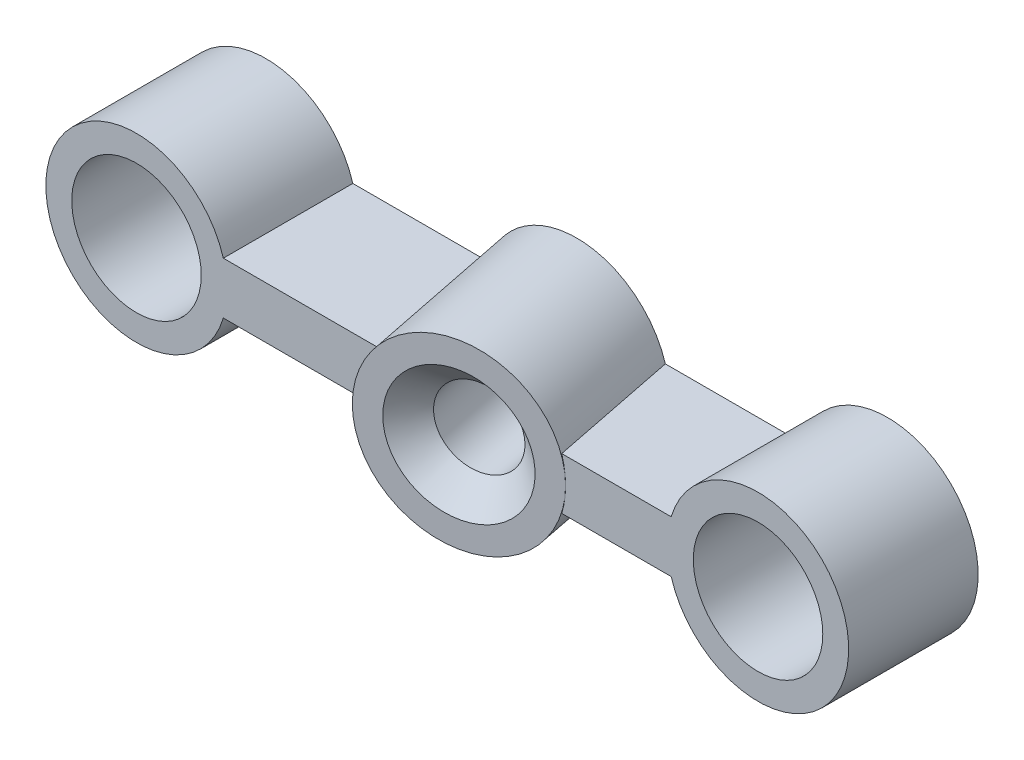
ISO-10303-21;
HEADER;
FILE_DESCRIPTION(('STEP AP214'),'2;1');
FILE_NAME('part.step','',(''),(''),'','','');
FILE_SCHEMA(('AUTOMOTIVE_DESIGN { 1 0 10303 214 1 1 1 1 }'));
ENDSEC;
DATA;
#1=APPLICATION_CONTEXT('core data for automotive mechanical design processes');
#2=APPLICATION_PROTOCOL_DEFINITION('international standard','automotive_design',2000,#1);
#3=PRODUCT_CONTEXT('',#1,'mechanical');
#4=PRODUCT('Part','Part','',(#3));
#5=PRODUCT_RELATED_PRODUCT_CATEGORY('part','',(#4));
#6=PRODUCT_DEFINITION_FORMATION('','',#4);
#7=PRODUCT_DEFINITION_CONTEXT('part definition',#1,'design');
#8=PRODUCT_DEFINITION('design','',#6,#7);
#9=PRODUCT_DEFINITION_SHAPE('','',#8);
#10=(LENGTH_UNIT() NAMED_UNIT(*) SI_UNIT(.MILLI.,.METRE.));
#11=(NAMED_UNIT(*) PLANE_ANGLE_UNIT() SI_UNIT($,.RADIAN.));
#12=(NAMED_UNIT(*) SI_UNIT($,.STERADIAN.) SOLID_ANGLE_UNIT());
#13=UNCERTAINTY_MEASURE_WITH_UNIT(LENGTH_MEASURE(1.E-05),#10,'distance_accuracy_value','');
#14=(GEOMETRIC_REPRESENTATION_CONTEXT(3) GLOBAL_UNCERTAINTY_ASSIGNED_CONTEXT((#13)) GLOBAL_UNIT_ASSIGNED_CONTEXT((#10,
#11,#12)) REPRESENTATION_CONTEXT('',''));
#15=CARTESIAN_POINT('',(0.,0.,0.));
#16=DIRECTION('',(0.,0.,1.));
#17=DIRECTION('',(1.,0.,0.));
#18=AXIS2_PLACEMENT_3D('',#15,#16,#17);
#19=CARTESIAN_POINT('',(-24.,0.,5.));
#20=DIRECTION('',(0.,0.,1.));
#21=DIRECTION('',(1.,0.,0.));
#22=AXIS2_PLACEMENT_3D('',#19,#20,#21);
#23=PLANE('',#22);
#24=CARTESIAN_POINT('',(0.,0.,5.));
#25=DIRECTION('',(0.,0.,1.));
#26=DIRECTION('',(1.,0.,0.));
#27=AXIS2_PLACEMENT_3D('',#24,#25,#26);
#28=CIRCLE('',#27,2.5);
#29=CARTESIAN_POINT('',(2.5,0.,5.));
#30=VERTEX_POINT('',#29);
#31=EDGE_CURVE('E144',#30,#30,#28,.T.);
#32=ORIENTED_EDGE('',*,*,#31,.F.);
#33=EDGE_LOOP('',(#32));
#34=FACE_BOUND('',#33,.T.);
#35=CARTESIAN_POINT('',(-11.,0.,5.));
#36=DIRECTION('',(0.,0.,1.));
#37=DIRECTION('',(-1.,0.,0.));
#38=AXIS2_PLACEMENT_3D('',#35,#36,#37);
#39=ELLIPSE('',#38,3.56931365951495,3.5);
#40=CARTESIAN_POINT('',(-7.57947372470259,1.,5.));
#41=VERTEX_POINT('',#40);
#42=CARTESIAN_POINT('',(-7.43068634048505,0.,5.));
#43=VERTEX_POINT('',#42);
#44=EDGE_CURVE('E51',#41,#43,#39,.F.);
#45=ORIENTED_EDGE('',*,*,#44,.T.);
#46=CARTESIAN_POINT('',(-7.57947372470258,-1.,5.));
#47=VERTEX_POINT('',#46);
#48=EDGE_CURVE('E55',#43,#47,#39,.F.);
#49=ORIENTED_EDGE('',*,*,#48,.T.);
#50=DIRECTION('',(1.,0.,0.));
#51=VECTOR('',#50,1.);
#52=CARTESIAN_POINT('',(-3.35410196624968,-1.,5.));
#53=LINE('',#52,#51);
#54=CARTESIAN_POINT('',(-3.35410196624969,-0.999999999999999,5.));
#55=VERTEX_POINT('',#54);
#56=EDGE_CURVE('E153',#47,#55,#53,.T.);
#57=ORIENTED_EDGE('',*,*,#56,.T.);
#58=CARTESIAN_POINT('',(0.,0.,5.));
#59=DIRECTION('',(0.,0.,1.));
#60=DIRECTION('',(1.,0.,0.));
#61=AXIS2_PLACEMENT_3D('',#58,#59,#60);
#62=CIRCLE('',#61,3.5);
#63=CARTESIAN_POINT('',(-3.35410196624968,1.,5.));
#64=VERTEX_POINT('',#63);
#65=EDGE_CURVE('E157',#55,#64,#62,.T.);
#66=ORIENTED_EDGE('',*,*,#65,.T.);
#67=DIRECTION('',(-1.,0.,0.));
#68=VECTOR('',#67,1.);
#69=CARTESIAN_POINT('',(-20.6458980337503,1.,5.));
#70=LINE('',#69,#68);
#71=EDGE_CURVE('E160',#64,#41,#70,.T.);
#72=ORIENTED_EDGE('',*,*,#71,.T.);
#73=EDGE_LOOP('',(#45,#49,#57,#66,#72));
#74=FACE_BOUND('',#73,.T.);
#75=ADVANCED_FACE('F35',(#34,#74),#23,.T.);
#76=CARTESIAN_POINT('',(-3.35410196624968,-1.,5.));
#77=DIRECTION('',(0.,1.,0.));
#78=DIRECTION('',(-1.,0.,0.));
#79=AXIS2_PLACEMENT_3D('',#76,#77,#78);
#80=PLANE('',#79);
#81=DIRECTION('',(-0.196116135138184,0.,-0.98058067569092));
#82=VECTOR('',#81,1.);
#83=CARTESIAN_POINT('',(-8.73864008370841,-1.,-0.795831795029124));
#84=LINE('',#83,#82);
#85=CARTESIAN_POINT('',(-8.57947372470259,-1.,0.));
#86=VERTEX_POINT('',#85);
#87=EDGE_CURVE('E137',#86,#47,#84,.F.);
#88=ORIENTED_EDGE('',*,*,#87,.F.);
#89=DIRECTION('',(1.,0.,0.));
#90=VECTOR('',#89,1.);
#91=CARTESIAN_POINT('',(-3.35410196624968,-1.,0.));
#92=LINE('',#91,#90);
#93=CARTESIAN_POINT('',(-3.35410196624969,-0.999999999999999,0.));
#94=VERTEX_POINT('',#93);
#95=EDGE_CURVE('E110',#86,#94,#92,.T.);
#96=ORIENTED_EDGE('',*,*,#95,.T.);
#97=DIRECTION('',(0.,0.,-1.));
#98=VECTOR('',#97,1.);
#99=CARTESIAN_POINT('',(-3.35410196624969,-0.999999999999999,5.));
#100=LINE('',#99,#98);
#101=EDGE_CURVE('E172',#55,#94,#100,.T.);
#102=ORIENTED_EDGE('',*,*,#101,.F.);
#103=ORIENTED_EDGE('',*,*,#56,.F.);
#104=EDGE_LOOP('',(#88,#96,#102,#103));
#105=FACE_BOUND('',#104,.T.);
#106=ADVANCED_FACE('F199',(#105),#80,.F.);
#107=CARTESIAN_POINT('',(-20.6458980337503,1.,5.));
#108=DIRECTION('',(0.,-1.,0.));
#109=DIRECTION('',(0.,0.,-1.));
#110=AXIS2_PLACEMENT_3D('',#107,#108,#109);
#111=PLANE('',#110);
#112=DIRECTION('',(-0.196116135138184,0.,-0.98058067569092));
#113=VECTOR('',#112,1.);
#114=CARTESIAN_POINT('',(-8.73864008370841,1.,-0.795831795029124));
#115=LINE('',#114,#113);
#116=CARTESIAN_POINT('',(-8.57947372470259,0.999999999999999,0.));
#117=VERTEX_POINT('',#116);
#118=EDGE_CURVE('E176',#41,#117,#115,.T.);
#119=ORIENTED_EDGE('',*,*,#118,.F.);
#120=ORIENTED_EDGE('',*,*,#71,.F.);
#121=DIRECTION('',(0.,0.,-1.));
#122=VECTOR('',#121,1.);
#123=CARTESIAN_POINT('',(-3.35410196624968,1.,5.));
#124=LINE('',#123,#122);
#125=CARTESIAN_POINT('',(-3.35410196624968,1.,0.));
#126=VERTEX_POINT('',#125);
#127=EDGE_CURVE('E169',#64,#126,#124,.T.);
#128=ORIENTED_EDGE('',*,*,#127,.T.);
#129=DIRECTION('',(-1.,0.,0.));
#130=VECTOR('',#129,1.);
#131=CARTESIAN_POINT('',(-20.6458980337503,1.,0.));
#132=LINE('',#131,#130);
#133=EDGE_CURVE('E154',#126,#117,#132,.T.);
#134=ORIENTED_EDGE('',*,*,#133,.T.);
#135=EDGE_LOOP('',(#119,#120,#128,#134));
#136=FACE_BOUND('',#135,.T.);
#137=ADVANCED_FACE('F205',(#136),#111,.F.);
#138=CARTESIAN_POINT('',(0.,0.,5.));
#139=DIRECTION('',(0.,0.,-1.));
#140=DIRECTION('',(-1.,0.,0.));
#141=AXIS2_PLACEMENT_3D('',#138,#139,#140);
#142=CYLINDRICAL_SURFACE('',#141,3.5);
#143=CARTESIAN_POINT('',(0.,0.,0.));
#144=DIRECTION('',(0.,0.,1.));
#145=DIRECTION('',(1.,0.,0.));
#146=AXIS2_PLACEMENT_3D('',#143,#144,#145);
#147=CIRCLE('',#146,3.5);
#148=EDGE_CURVE('E125',#94,#126,#147,.T.);
#149=ORIENTED_EDGE('',*,*,#148,.T.);
#150=ORIENTED_EDGE('',*,*,#127,.F.);
#151=ORIENTED_EDGE('',*,*,#65,.F.);
#152=ORIENTED_EDGE('',*,*,#101,.T.);
#153=EDGE_LOOP('',(#149,#150,#151,#152));
#154=FACE_BOUND('',#153,.T.);
#155=ADVANCED_FACE('F232',(#154),#142,.T.);
#156=CARTESIAN_POINT('',(0.,0.,5.));
#157=DIRECTION('',(0.,0.,-1.));
#158=DIRECTION('',(-1.,0.,0.));
#159=AXIS2_PLACEMENT_3D('',#156,#157,#158);
#160=CYLINDRICAL_SURFACE('',#159,2.5);
#161=ORIENTED_EDGE('',*,*,#31,.T.);
#162=EDGE_LOOP('',(#161));
#163=FACE_BOUND('',#162,.T.);
#164=CARTESIAN_POINT('',(0.,0.,0.));
#165=DIRECTION('',(0.,0.,1.));
#166=DIRECTION('',(1.,0.,0.));
#167=AXIS2_PLACEMENT_3D('',#164,#165,#166);
#168=CIRCLE('',#167,2.5);
#169=CARTESIAN_POINT('',(2.5,0.,0.));
#170=VERTEX_POINT('',#169);
#171=EDGE_CURVE('E142',#170,#170,#168,.T.);
#172=ORIENTED_EDGE('',*,*,#171,.F.);
#173=EDGE_LOOP('',(#172));
#174=FACE_BOUND('',#173,.T.);
#175=ADVANCED_FACE('F230',(#163,#174),#160,.F.);
#176=CARTESIAN_POINT('',(-12.0276076561098,0.,-0.138038280548852));
#177=DIRECTION('',(-0.196116135138184,0.,-0.98058067569092));
#178=DIRECTION('',(-0.98058067569092,0.,0.196116135138184));
#179=AXIS2_PLACEMENT_3D('',#176,#177,#178);
#180=CYLINDRICAL_SURFACE('',#179,3.5);
#181=DIRECTION('',(-0.196116135138184,0.,-0.98058067569092));
#182=VECTOR('',#181,1.);
#183=CARTESIAN_POINT('',(-15.3165752285111,-1.,0.51975523393142));
#184=LINE('',#183,#182);
#185=CARTESIAN_POINT('',(-14.4205262752974,-1.,5.));
#186=VERTEX_POINT('',#185);
#187=CARTESIAN_POINT('',(-15.4205262752974,-1.,0.));
#188=VERTEX_POINT('',#187);
#189=EDGE_CURVE('E120',#186,#188,#184,.T.);
#190=ORIENTED_EDGE('',*,*,#189,.T.);
#191=CARTESIAN_POINT('',(-12.,0.,0.));
#192=DIRECTION('',(0.,0.,1.));
#193=DIRECTION('',(-1.,0.,0.));
#194=AXIS2_PLACEMENT_3D('',#191,#192,#193);
#195=ELLIPSE('',#194,3.56931365951495,3.5);
#196=EDGE_CURVE('E102',#188,#86,#195,.T.);
#197=ORIENTED_EDGE('',*,*,#196,.T.);
#198=ORIENTED_EDGE('',*,*,#87,.T.);
#199=ORIENTED_EDGE('',*,*,#48,.F.);
#200=CARTESIAN_POINT('',(-10.8627187054033,0.,5.68640647298365));
#201=DIRECTION('',(-0.196116135138184,0.,-0.98058067569092));
#202=DIRECTION('',(-0.98058067569092,0.,0.196116135138184));
#203=AXIS2_PLACEMENT_3D('',#200,#201,#202);
#204=CIRCLE('',#203,3.5);
#205=EDGE_CURVE('E341',#43,#43,#204,.T.);
#206=ORIENTED_EDGE('',*,*,#205,.T.);
#207=ORIENTED_EDGE('',*,*,#44,.F.);
#208=ORIENTED_EDGE('',*,*,#118,.T.);
#209=CARTESIAN_POINT('',(-15.4205262752974,1.,0.));
#210=VERTEX_POINT('',#209);
#211=EDGE_CURVE('E115',#117,#210,#195,.T.);
#212=ORIENTED_EDGE('',*,*,#211,.T.);
#213=DIRECTION('',(-0.196116135138184,0.,-0.98058067569092));
#214=VECTOR('',#213,1.);
#215=CARTESIAN_POINT('',(-15.3165752285111,1.,0.51975523393142));
#216=LINE('',#215,#214);
#217=CARTESIAN_POINT('',(-14.4205262752974,1.,5.));
#218=VERTEX_POINT('',#217);
#219=EDGE_CURVE('E179',#210,#218,#216,.F.);
#220=ORIENTED_EDGE('',*,*,#219,.T.);
#221=EDGE_CURVE('E131',#186,#218,#39,.F.);
#222=ORIENTED_EDGE('',*,*,#221,.F.);
#223=EDGE_LOOP('',(#190,#197,#198,#199,#206,#207,#208,#212,#220,#222));
#224=FACE_BOUND('',#223,.T.);
#225=ADVANCED_FACE('F128',(#224),#180,.T.);
#226=CARTESIAN_POINT('',(-7.43068634048505,0.,5.));
#227=DIRECTION('',(-0.196116135138184,0.,-0.98058067569092));
#228=DIRECTION('',(-0.98058067569092,0.,0.196116135138184));
#229=AXIS2_PLACEMENT_3D('',#226,#227,#228);
#230=PLANE('',#229);
#231=CARTESIAN_POINT('',(-10.8627187054033,0.,5.68640647298364));
#232=DIRECTION('',(-0.196116135138184,0.,-0.98058067569092));
#233=DIRECTION('',(-0.98058067569092,0.,0.196116135138184));
#234=AXIS2_PLACEMENT_3D('',#231,#232,#233);
#235=CIRCLE('',#234,2.50000000000001);
#236=CARTESIAN_POINT('',(-13.3141703946306,0.,6.17669681082911));
#237=VERTEX_POINT('',#236);
#238=EDGE_CURVE('E44',#237,#237,#235,.T.);
#239=ORIENTED_EDGE('',*,*,#238,.T.);
#240=EDGE_LOOP('',(#239));
#241=FACE_BOUND('',#240,.T.);
#242=ORIENTED_EDGE('',*,*,#205,.F.);
#243=EDGE_LOOP('',(#242));
#244=FACE_BOUND('',#243,.T.);
#245=ADVANCED_FACE('F185',(#241,#244),#230,.F.);
#246=CARTESIAN_POINT('',(-24.,0.,5.));
#247=DIRECTION('',(0.,0.,-1.));
#248=DIRECTION('',(-1.,0.,0.));
#249=AXIS2_PLACEMENT_3D('',#246,#247,#248);
#250=CYLINDRICAL_SURFACE('',#249,2.5);
#251=CARTESIAN_POINT('',(-24.,0.,5.));
#252=DIRECTION('',(0.,0.,1.));
#253=DIRECTION('',(1.,0.,0.));
#254=AXIS2_PLACEMENT_3D('',#251,#252,#253);
#255=CIRCLE('',#254,2.5);
#256=CARTESIAN_POINT('',(-21.5,0.,5.));
#257=VERTEX_POINT('',#256);
#258=EDGE_CURVE('E135',#257,#257,#255,.T.);
#259=ORIENTED_EDGE('',*,*,#258,.T.);
#260=EDGE_LOOP('',(#259));
#261=FACE_BOUND('',#260,.T.);
#262=CARTESIAN_POINT('',(-24.,0.,0.));
#263=DIRECTION('',(0.,0.,1.));
#264=DIRECTION('',(1.,0.,0.));
#265=AXIS2_PLACEMENT_3D('',#262,#263,#264);
#266=CIRCLE('',#265,2.5);
#267=CARTESIAN_POINT('',(-21.5,0.,0.));
#268=VERTEX_POINT('',#267);
#269=EDGE_CURVE('E132',#268,#268,#266,.T.);
#270=ORIENTED_EDGE('',*,*,#269,.F.);
#271=EDGE_LOOP('',(#270));
#272=FACE_BOUND('',#271,.T.);
#273=ADVANCED_FACE('F219',(#261,#272),#250,.F.);
#274=CARTESIAN_POINT('',(-24.,0.,5.));
#275=DIRECTION('',(0.,0.,-1.));
#276=DIRECTION('',(-1.,0.,0.));
#277=AXIS2_PLACEMENT_3D('',#274,#275,#276);
#278=CYLINDRICAL_SURFACE('',#277,3.5);
#279=CARTESIAN_POINT('',(-24.,0.,0.));
#280=DIRECTION('',(0.,0.,1.));
#281=DIRECTION('',(1.,0.,0.));
#282=AXIS2_PLACEMENT_3D('',#279,#280,#281);
#283=CIRCLE('',#282,3.5);
#284=CARTESIAN_POINT('',(-20.6458980337503,1.,0.));
#285=VERTEX_POINT('',#284);
#286=CARTESIAN_POINT('',(-20.6458980337503,-1.,0.));
#287=VERTEX_POINT('',#286);
#288=EDGE_CURVE('E147',#285,#287,#283,.T.);
#289=ORIENTED_EDGE('',*,*,#288,.T.);
#290=DIRECTION('',(0.,0.,-1.));
#291=VECTOR('',#290,1.);
#292=CARTESIAN_POINT('',(-20.6458980337503,-1.,5.));
#293=LINE('',#292,#291);
#294=CARTESIAN_POINT('',(-20.6458980337503,-1.,5.));
#295=VERTEX_POINT('',#294);
#296=EDGE_CURVE('E123',#295,#287,#293,.T.);
#297=ORIENTED_EDGE('',*,*,#296,.F.);
#298=CARTESIAN_POINT('',(-24.,0.,5.));
#299=DIRECTION('',(0.,0.,1.));
#300=DIRECTION('',(1.,0.,0.));
#301=AXIS2_PLACEMENT_3D('',#298,#299,#300);
#302=CIRCLE('',#301,3.5);
#303=CARTESIAN_POINT('',(-20.6458980337503,1.,5.));
#304=VERTEX_POINT('',#303);
#305=EDGE_CURVE('E150',#304,#295,#302,.T.);
#306=ORIENTED_EDGE('',*,*,#305,.F.);
#307=DIRECTION('',(0.,0.,-1.));
#308=VECTOR('',#307,1.);
#309=CARTESIAN_POINT('',(-20.6458980337503,1.,5.));
#310=LINE('',#309,#308);
#311=EDGE_CURVE('E162',#304,#285,#310,.T.);
#312=ORIENTED_EDGE('',*,*,#311,.T.);
#313=EDGE_LOOP('',(#289,#297,#306,#312));
#314=FACE_BOUND('',#313,.T.);
#315=ADVANCED_FACE('F222',(#314),#278,.T.);
#316=ORIENTED_EDGE('',*,*,#219,.F.);
#317=EDGE_CURVE('E165',#210,#285,#132,.T.);
#318=ORIENTED_EDGE('',*,*,#317,.T.);
#319=ORIENTED_EDGE('',*,*,#311,.F.);
#320=EDGE_CURVE('E159',#218,#304,#70,.T.);
#321=ORIENTED_EDGE('',*,*,#320,.F.);
#322=EDGE_LOOP('',(#316,#318,#319,#321));
#323=FACE_BOUND('',#322,.T.);
#324=ADVANCED_FACE('F259',(#323),#111,.F.);
#325=ORIENTED_EDGE('',*,*,#189,.F.);
#326=EDGE_CURVE('E155',#295,#186,#53,.T.);
#327=ORIENTED_EDGE('',*,*,#326,.F.);
#328=ORIENTED_EDGE('',*,*,#296,.T.);
#329=EDGE_CURVE('E107',#287,#188,#92,.T.);
#330=ORIENTED_EDGE('',*,*,#329,.T.);
#331=EDGE_LOOP('',(#325,#327,#328,#330));
#332=FACE_BOUND('',#331,.T.);
#333=ADVANCED_FACE('F119',(#332),#80,.F.);
#334=CARTESIAN_POINT('',(-24.,0.,0.));
#335=DIRECTION('',(0.,0.,1.));
#336=DIRECTION('',(1.,0.,0.));
#337=AXIS2_PLACEMENT_3D('',#334,#335,#336);
#338=PLANE('',#337);
#339=ORIENTED_EDGE('',*,*,#288,.F.);
#340=ORIENTED_EDGE('',*,*,#317,.F.);
#341=ORIENTED_EDGE('',*,*,#211,.F.);
#342=ORIENTED_EDGE('',*,*,#133,.F.);
#343=ORIENTED_EDGE('',*,*,#148,.F.);
#344=ORIENTED_EDGE('',*,*,#95,.F.);
#345=ORIENTED_EDGE('',*,*,#196,.F.);
#346=ORIENTED_EDGE('',*,*,#329,.F.);
#347=EDGE_LOOP('',(#339,#340,#341,#342,#343,#344,#345,#346));
#348=FACE_BOUND('',#347,.T.);
#349=ORIENTED_EDGE('',*,*,#269,.T.);
#350=EDGE_LOOP('',(#349));
#351=FACE_BOUND('',#350,.T.);
#352=CARTESIAN_POINT('',(-12.,0.,0.));
#353=DIRECTION('',(0.,0.,1.));
#354=DIRECTION('',(-1.,0.,0.));
#355=AXIS2_PLACEMENT_3D('',#352,#353,#354);
#356=ELLIPSE('',#355,1.52970585407784,1.5);
#357=CARTESIAN_POINT('',(-13.5297058540778,0.,0.));
#358=VERTEX_POINT('',#357);
#359=EDGE_CURVE('E116',#358,#358,#356,.F.);
#360=ORIENTED_EDGE('',*,*,#359,.F.);
#361=EDGE_LOOP('',(#360));
#362=FACE_BOUND('',#361,.T.);
#363=ORIENTED_EDGE('',*,*,#171,.T.);
#364=EDGE_LOOP('',(#363));
#365=FACE_BOUND('',#364,.T.);
#366=ADVANCED_FACE('F105',(#348,#351,#362,#365),#338,.F.);
#367=ORIENTED_EDGE('',*,*,#326,.T.);
#368=ORIENTED_EDGE('',*,*,#221,.T.);
#369=ORIENTED_EDGE('',*,*,#320,.T.);
#370=ORIENTED_EDGE('',*,*,#305,.T.);
#371=EDGE_LOOP('',(#367,#368,#369,#370));
#372=FACE_BOUND('',#371,.T.);
#373=ORIENTED_EDGE('',*,*,#258,.F.);
#374=EDGE_LOOP('',(#373));
#375=FACE_BOUND('',#374,.T.);
#376=ADVANCED_FACE('F194',(#372,#375),#23,.T.);
#377=CARTESIAN_POINT('',(-10.1783052026986,0.,9.10847398650701));
#378=DIRECTION('',(-0.196116135138184,0.,-0.98058067569092));
#379=DIRECTION('',(-0.98058067569092,0.,0.196116135138184));
#380=AXIS2_PLACEMENT_3D('',#377,#378,#379);
#381=CYLINDRICAL_SURFACE('',#380,1.5);
#382=CARTESIAN_POINT('',(-11.0588348405415,0.,4.70582579729271));
#383=DIRECTION('',(-0.196116135138185,0.,-0.98058067569092));
#384=DIRECTION('',(-0.98058067569092,0.,0.196116135138185));
#385=AXIS2_PLACEMENT_3D('',#382,#383,#384);
#386=CIRCLE('',#385,1.5);
#387=CARTESIAN_POINT('',(-12.5297058540778,0.,4.99999999999999));
#388=VERTEX_POINT('',#387);
#389=EDGE_CURVE('E11',#388,#388,#386,.F.);
#390=ORIENTED_EDGE('',*,*,#389,.T.);
#391=EDGE_LOOP('',(#390));
#392=FACE_BOUND('',#391,.T.);
#393=ORIENTED_EDGE('',*,*,#359,.T.);
#394=EDGE_LOOP('',(#393));
#395=FACE_BOUND('',#394,.T.);
#396=ADVANCED_FACE('F189',(#392,#395),#381,.F.);
#397=CARTESIAN_POINT('',(-10.8627187054033,0.,5.68640647298364));
#398=DIRECTION('',(0.196116135138185,0.,0.98058067569092));
#399=DIRECTION('',(0.98058067569092,0.,-0.196116135138185));
#400=AXIS2_PLACEMENT_3D('',#397,#398,#399);
#401=CONICAL_SURFACE('',#400,2.50000000000001,0.785398163397446);
#402=ORIENTED_EDGE('',*,*,#389,.F.);
#403=EDGE_LOOP('',(#402));
#404=FACE_BOUND('',#403,.T.);
#405=ORIENTED_EDGE('',*,*,#238,.F.);
#406=EDGE_LOOP('',(#405));
#407=FACE_BOUND('',#406,.T.);
#408=ADVANCED_FACE('F38',(#404,#407),#401,.F.);
#409=CLOSED_SHELL('',(#75,#106,#137,#155,#175,#225,#245,#273,#315,#324,#333,#366,#376,#396,#408));
#410=MANIFOLD_SOLID_BREP('B2',#409);
#411=ADVANCED_BREP_SHAPE_REPRESENTATION('',(#18,#410),#14);
#412=SHAPE_DEFINITION_REPRESENTATION(#9,#411);
ENDSEC;
END-ISO-10303-21;
